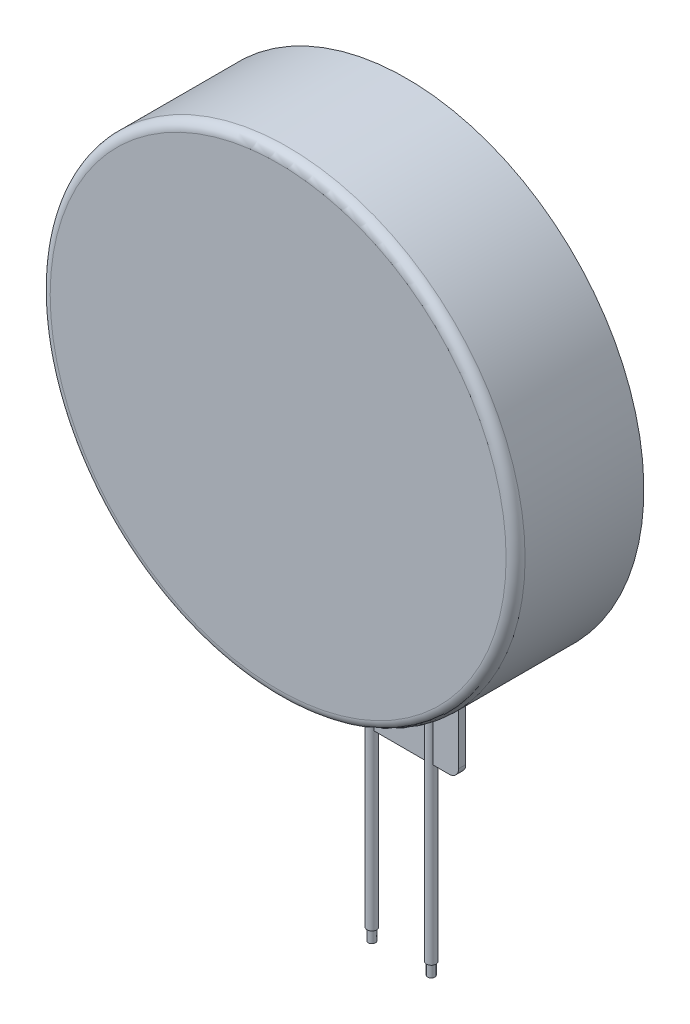
ISO-10303-21;
HEADER;
FILE_DESCRIPTION(('STEP AP214'),'2;1');
FILE_NAME('part.step','',(''),(''),'','','');
FILE_SCHEMA(('AUTOMOTIVE_DESIGN { 1 0 10303 214 1 1 1 1 }'));
ENDSEC;
DATA;
#1=APPLICATION_CONTEXT('core data for automotive mechanical design processes');
#2=APPLICATION_PROTOCOL_DEFINITION('international standard','automotive_design',2000,#1);
#3=PRODUCT_CONTEXT('',#1,'mechanical');
#4=PRODUCT('Part','Part','',(#3));
#5=PRODUCT_RELATED_PRODUCT_CATEGORY('part','',(#4));
#6=PRODUCT_DEFINITION_FORMATION('','',#4);
#7=PRODUCT_DEFINITION_CONTEXT('part definition',#1,'design');
#8=PRODUCT_DEFINITION('design','',#6,#7);
#9=PRODUCT_DEFINITION_SHAPE('','',#8);
#10=(LENGTH_UNIT() NAMED_UNIT(*) SI_UNIT(.MILLI.,.METRE.));
#11=(NAMED_UNIT(*) PLANE_ANGLE_UNIT() SI_UNIT($,.RADIAN.));
#12=(NAMED_UNIT(*) SI_UNIT($,.STERADIAN.) SOLID_ANGLE_UNIT());
#13=UNCERTAINTY_MEASURE_WITH_UNIT(LENGTH_MEASURE(1.E-05),#10,'distance_accuracy_value','');
#14=(GEOMETRIC_REPRESENTATION_CONTEXT(3) GLOBAL_UNCERTAINTY_ASSIGNED_CONTEXT((#13)) GLOBAL_UNIT_ASSIGNED_CONTEXT((#10,
#11,#12)) REPRESENTATION_CONTEXT('',''));
#15=CARTESIAN_POINT('',(0.,0.,0.));
#16=DIRECTION('',(0.,0.,1.));
#17=DIRECTION('',(1.,0.,0.));
#18=AXIS2_PLACEMENT_3D('',#15,#16,#17);
#19=CARTESIAN_POINT('',(0.625,-4.89122918275927,0.101));
#20=DIRECTION('',(0.,-1.,0.));
#21=DIRECTION('',(0.,0.,-1.));
#22=AXIS2_PLACEMENT_3D('',#19,#20,#21);
#23=CYLINDRICAL_SURFACE('',#22,0.101);
#24=CARTESIAN_POINT('',(0.625,-4.89122918275927,0.101));
#25=DIRECTION('',(0.,-1.,0.));
#26=DIRECTION('',(0.,0.,-1.));
#27=AXIS2_PLACEMENT_3D('',#24,#25,#26);
#28=CIRCLE('',#27,0.101);
#29=CARTESIAN_POINT('',(0.625,-4.89122918275927,0.));
#30=VERTEX_POINT('',#29);
#31=EDGE_CURVE('E12',#30,#30,#28,.T.);
#32=ORIENTED_EDGE('',*,*,#31,.T.);
#33=EDGE_LOOP('',(#32));
#34=FACE_BOUND('',#33,.T.);
#35=CARTESIAN_POINT('',(0.625,-10.7412291827593,0.101));
#36=DIRECTION('',(0.,-1.,0.));
#37=DIRECTION('',(0.,0.,-1.));
#38=AXIS2_PLACEMENT_3D('',#35,#36,#37);
#39=CIRCLE('',#38,0.101);
#40=CARTESIAN_POINT('',(0.625,-10.7412291827593,0.));
#41=VERTEX_POINT('',#40);
#42=EDGE_CURVE('E45',#41,#41,#39,.F.);
#43=ORIENTED_EDGE('',*,*,#42,.T.);
#44=EDGE_LOOP('',(#43));
#45=FACE_BOUND('',#44,.T.);
#46=ADVANCED_FACE('F42',(#34,#45),#23,.T.);
#47=CARTESIAN_POINT('',(0.625,-4.89122918275927,0.101));
#48=DIRECTION('',(0.,-1.,0.));
#49=DIRECTION('',(0.,0.,-1.));
#50=AXIS2_PLACEMENT_3D('',#47,#48,#49);
#51=PLANE('',#50);
#52=ORIENTED_EDGE('',*,*,#31,.F.);
#53=EDGE_LOOP('',(#52));
#54=FACE_BOUND('',#53,.T.);
#55=ADVANCED_FACE('F65',(#54),#51,.F.);
#56=CARTESIAN_POINT('',(0.,-10.7412291827593,1.35));
#57=DIRECTION('',(0.,-1.,0.));
#58=DIRECTION('',(0.,0.,-1.));
#59=AXIS2_PLACEMENT_3D('',#56,#57,#58);
#60=PLANE('',#59);
#61=ORIENTED_EDGE('',*,*,#42,.F.);
#62=EDGE_LOOP('',(#61));
#63=FACE_BOUND('',#62,.T.);
#64=CARTESIAN_POINT('',(0.625,-10.7412291827593,0.101));
#65=DIRECTION('',(0.,-1.,0.));
#66=DIRECTION('',(0.,0.,-1.));
#67=AXIS2_PLACEMENT_3D('',#64,#65,#66);
#68=CIRCLE('',#67,0.075);
#69=CARTESIAN_POINT('',(0.625,-10.7412291827593,0.026));
#70=VERTEX_POINT('',#69);
#71=EDGE_CURVE('E52',#70,#70,#68,.T.);
#72=ORIENTED_EDGE('',*,*,#71,.F.);
#73=EDGE_LOOP('',(#72));
#74=FACE_BOUND('',#73,.T.);
#75=ADVANCED_FACE('F63',(#63,#74),#60,.T.);
#76=CARTESIAN_POINT('',(0.625,-10.7412291827593,0.101));
#77=DIRECTION('',(0.,-1.,0.));
#78=DIRECTION('',(0.,0.,-1.));
#79=AXIS2_PLACEMENT_3D('',#76,#77,#78);
#80=CYLINDRICAL_SURFACE('',#79,0.075);
#81=ORIENTED_EDGE('',*,*,#71,.T.);
#82=EDGE_LOOP('',(#81));
#83=FACE_BOUND('',#82,.T.);
#84=CARTESIAN_POINT('',(0.625,-10.9912291827593,0.101));
#85=DIRECTION('',(0.,-1.,0.));
#86=DIRECTION('',(0.,0.,-1.));
#87=AXIS2_PLACEMENT_3D('',#84,#85,#86);
#88=CIRCLE('',#87,0.075);
#89=CARTESIAN_POINT('',(0.625,-10.9912291827593,0.026));
#90=VERTEX_POINT('',#89);
#91=EDGE_CURVE('E54',#90,#90,#88,.T.);
#92=ORIENTED_EDGE('',*,*,#91,.F.);
#93=EDGE_LOOP('',(#92));
#94=FACE_BOUND('',#93,.T.);
#95=ADVANCED_FACE('F60',(#83,#94),#80,.T.);
#96=CARTESIAN_POINT('',(0.625,-10.9912291827593,0.101));
#97=DIRECTION('',(0.,-1.,0.));
#98=DIRECTION('',(0.,0.,-1.));
#99=AXIS2_PLACEMENT_3D('',#96,#97,#98);
#100=PLANE('',#99);
#101=ORIENTED_EDGE('',*,*,#91,.T.);
#102=EDGE_LOOP('',(#101));
#103=FACE_BOUND('',#102,.T.);
#104=ADVANCED_FACE('F72',(#103),#100,.T.);
#105=CLOSED_SHELL('',(#46,#55,#75,#95,#104));
#106=MANIFOLD_SOLID_BREP('B2',#105);
#107=CARTESIAN_POINT('',(-0.625,-4.89122918275927,0.101));
#108=DIRECTION('',(0.,-1.,0.));
#109=DIRECTION('',(0.,0.,-1.));
#110=AXIS2_PLACEMENT_3D('',#107,#108,#109);
#111=CYLINDRICAL_SURFACE('',#110,0.101);
#112=CARTESIAN_POINT('',(-0.625,-4.89122918275927,0.101));
#113=DIRECTION('',(0.,-1.,0.));
#114=DIRECTION('',(0.,0.,-1.));
#115=AXIS2_PLACEMENT_3D('',#112,#113,#114);
#116=CIRCLE('',#115,0.101);
#117=CARTESIAN_POINT('',(-0.625,-4.89122918275927,0.));
#118=VERTEX_POINT('',#117);
#119=EDGE_CURVE('E41',#118,#118,#116,.T.);
#120=ORIENTED_EDGE('',*,*,#119,.T.);
#121=EDGE_LOOP('',(#120));
#122=FACE_BOUND('',#121,.T.);
#123=CARTESIAN_POINT('',(-0.625,-10.7412291827593,0.101));
#124=DIRECTION('',(0.,-1.,0.));
#125=DIRECTION('',(0.,0.,-1.));
#126=AXIS2_PLACEMENT_3D('',#123,#124,#125);
#127=CIRCLE('',#126,0.101);
#128=CARTESIAN_POINT('',(-0.625,-10.7412291827593,0.));
#129=VERTEX_POINT('',#128);
#130=EDGE_CURVE('E139',#129,#129,#127,.F.);
#131=ORIENTED_EDGE('',*,*,#130,.T.);
#132=EDGE_LOOP('',(#131));
#133=FACE_BOUND('',#132,.T.);
#134=ADVANCED_FACE('F136',(#122,#133),#111,.T.);
#135=CARTESIAN_POINT('',(-0.625,-4.89122918275927,0.101));
#136=DIRECTION('',(0.,-1.,0.));
#137=DIRECTION('',(0.,0.,-1.));
#138=AXIS2_PLACEMENT_3D('',#135,#136,#137);
#139=PLANE('',#138);
#140=ORIENTED_EDGE('',*,*,#119,.F.);
#141=EDGE_LOOP('',(#140));
#142=FACE_BOUND('',#141,.T.);
#143=ADVANCED_FACE('F159',(#142),#139,.F.);
#144=CARTESIAN_POINT('',(0.,-10.7412291827593,1.35));
#145=DIRECTION('',(0.,-1.,0.));
#146=DIRECTION('',(0.,0.,-1.));
#147=AXIS2_PLACEMENT_3D('',#144,#145,#146);
#148=PLANE('',#147);
#149=ORIENTED_EDGE('',*,*,#130,.F.);
#150=EDGE_LOOP('',(#149));
#151=FACE_BOUND('',#150,.T.);
#152=CARTESIAN_POINT('',(-0.625,-10.7412291827593,0.101));
#153=DIRECTION('',(0.,-1.,0.));
#154=DIRECTION('',(0.,0.,-1.));
#155=AXIS2_PLACEMENT_3D('',#152,#153,#154);
#156=CIRCLE('',#155,0.075);
#157=CARTESIAN_POINT('',(-0.625,-10.7412291827593,0.026));
#158=VERTEX_POINT('',#157);
#159=EDGE_CURVE('E146',#158,#158,#156,.T.);
#160=ORIENTED_EDGE('',*,*,#159,.F.);
#161=EDGE_LOOP('',(#160));
#162=FACE_BOUND('',#161,.T.);
#163=ADVANCED_FACE('F157',(#151,#162),#148,.T.);
#164=CARTESIAN_POINT('',(-0.625,-10.7412291827593,0.101));
#165=DIRECTION('',(0.,-1.,0.));
#166=DIRECTION('',(0.,0.,-1.));
#167=AXIS2_PLACEMENT_3D('',#164,#165,#166);
#168=CYLINDRICAL_SURFACE('',#167,0.075);
#169=ORIENTED_EDGE('',*,*,#159,.T.);
#170=EDGE_LOOP('',(#169));
#171=FACE_BOUND('',#170,.T.);
#172=CARTESIAN_POINT('',(-0.625,-10.9912291827593,0.101));
#173=DIRECTION('',(0.,-1.,0.));
#174=DIRECTION('',(0.,0.,-1.));
#175=AXIS2_PLACEMENT_3D('',#172,#173,#174);
#176=CIRCLE('',#175,0.075);
#177=CARTESIAN_POINT('',(-0.625,-10.9912291827593,0.026));
#178=VERTEX_POINT('',#177);
#179=EDGE_CURVE('E148',#178,#178,#176,.T.);
#180=ORIENTED_EDGE('',*,*,#179,.F.);
#181=EDGE_LOOP('',(#180));
#182=FACE_BOUND('',#181,.T.);
#183=ADVANCED_FACE('F154',(#171,#182),#168,.T.);
#184=CARTESIAN_POINT('',(-0.625,-10.9912291827593,0.101));
#185=DIRECTION('',(0.,-1.,0.));
#186=DIRECTION('',(0.,0.,-1.));
#187=AXIS2_PLACEMENT_3D('',#184,#185,#186);
#188=PLANE('',#187);
#189=ORIENTED_EDGE('',*,*,#179,.T.);
#190=EDGE_LOOP('',(#189));
#191=FACE_BOUND('',#190,.T.);
#192=ADVANCED_FACE('F166',(#191),#188,.T.);
#193=CLOSED_SHELL('',(#134,#143,#163,#183,#192));
#194=MANIFOLD_SOLID_BREP('B7',#193);
#195=CARTESIAN_POINT('',(0.,0.,2.7));
#196=DIRECTION('',(0.,0.,-1.));
#197=DIRECTION('',(-1.,0.,0.));
#198=AXIS2_PLACEMENT_3D('',#195,#196,#197);
#199=CYLINDRICAL_SURFACE('',#198,5.);
#200=CARTESIAN_POINT('',(0.,0.,2.5));
#201=DIRECTION('',(0.,0.,1.));
#202=DIRECTION('',(1.,0.,0.));
#203=AXIS2_PLACEMENT_3D('',#200,#201,#202);
#204=CIRCLE('',#203,5.);
#205=CARTESIAN_POINT('',(5.,0.,2.5));
#206=VERTEX_POINT('',#205);
#207=EDGE_CURVE('E134',#206,#206,#204,.F.);
#208=ORIENTED_EDGE('',*,*,#207,.T.);
#209=EDGE_LOOP('',(#208));
#210=FACE_BOUND('',#209,.T.);
#211=CARTESIAN_POINT('',(0.,0.,0.));
#212=DIRECTION('',(0.,0.,1.));
#213=DIRECTION('',(1.,0.,0.));
#214=AXIS2_PLACEMENT_3D('',#211,#212,#213);
#215=CIRCLE('',#214,5.);
#216=CARTESIAN_POINT('',(1.25,-4.84122918275927,0.));
#217=VERTEX_POINT('',#216);
#218=CARTESIAN_POINT('',(-1.25,-4.84122918275927,0.));
#219=VERTEX_POINT('',#218);
#220=EDGE_CURVE('E277',#217,#219,#215,.T.);
#221=ORIENTED_EDGE('',*,*,#220,.T.);
#222=DIRECTION('',(0.,0.,-1.));
#223=VECTOR('',#222,1.);
#224=CARTESIAN_POINT('',(-1.25,-4.84122918275927,2.7));
#225=LINE('',#224,#223);
#226=CARTESIAN_POINT('',(-1.25,-4.84122918275927,0.15));
#227=VERTEX_POINT('',#226);
#228=EDGE_CURVE('E288',#219,#227,#225,.F.);
#229=ORIENTED_EDGE('',*,*,#228,.T.);
#230=CARTESIAN_POINT('',(0.,0.,0.15));
#231=DIRECTION('',(0.,0.,1.));
#232=DIRECTION('',(1.,0.,0.));
#233=AXIS2_PLACEMENT_3D('',#230,#231,#232);
#234=CIRCLE('',#233,5.);
#235=CARTESIAN_POINT('',(1.25,-4.84122918275927,0.15));
#236=VERTEX_POINT('',#235);
#237=EDGE_CURVE('E287',#227,#236,#234,.T.);
#238=ORIENTED_EDGE('',*,*,#237,.T.);
#239=DIRECTION('',(0.,0.,-1.));
#240=VECTOR('',#239,1.);
#241=CARTESIAN_POINT('',(1.25,-4.84122918275927,2.7));
#242=LINE('',#241,#240);
#243=EDGE_CURVE('E291',#236,#217,#242,.T.);
#244=ORIENTED_EDGE('',*,*,#243,.T.);
#245=EDGE_LOOP('',(#221,#229,#238,#244));
#246=FACE_BOUND('',#245,.T.);
#247=ADVANCED_FACE('F221',(#210,#246),#199,.T.);
#248=CARTESIAN_POINT('',(0.,0.,2.7));
#249=DIRECTION('',(0.,0.,1.));
#250=DIRECTION('',(1.,0.,0.));
#251=AXIS2_PLACEMENT_3D('',#248,#249,#250);
#252=PLANE('',#251);
#253=CARTESIAN_POINT('',(0.,0.,2.7));
#254=DIRECTION('',(0.,0.,1.));
#255=DIRECTION('',(1.,0.,0.));
#256=AXIS2_PLACEMENT_3D('',#253,#254,#255);
#257=CIRCLE('',#256,4.8);
#258=CARTESIAN_POINT('',(4.8,0.,2.7));
#259=VERTEX_POINT('',#258);
#260=EDGE_CURVE('E229',#259,#259,#257,.T.);
#261=ORIENTED_EDGE('',*,*,#260,.T.);
#262=EDGE_LOOP('',(#261));
#263=FACE_BOUND('',#262,.T.);
#264=ADVANCED_FACE('F326',(#263),#252,.T.);
#265=CARTESIAN_POINT('',(0.,0.,0.));
#266=DIRECTION('',(0.,0.,1.));
#267=DIRECTION('',(1.,0.,0.));
#268=AXIS2_PLACEMENT_3D('',#265,#266,#267);
#269=PLANE('',#268);
#270=DIRECTION('',(-1.,0.,0.));
#271=VECTOR('',#270,1.);
#272=CARTESIAN_POINT('',(-1.25,-7.09122918275927,0.));
#273=LINE('',#272,#271);
#274=CARTESIAN_POINT('',(1.05,-7.09122918275927,0.));
#275=VERTEX_POINT('',#274);
#276=CARTESIAN_POINT('',(-1.05,-7.09122918275927,0.));
#277=VERTEX_POINT('',#276);
#278=EDGE_CURVE('E300',#275,#277,#273,.T.);
#279=ORIENTED_EDGE('',*,*,#278,.T.);
#280=CARTESIAN_POINT('',(-1.05,-6.89122918275927,0.));
#281=DIRECTION('',(0.,0.,1.));
#282=DIRECTION('',(1.,0.,0.));
#283=AXIS2_PLACEMENT_3D('',#280,#281,#282);
#284=CIRCLE('',#283,0.2);
#285=CARTESIAN_POINT('',(-1.25,-6.89122918275927,0.));
#286=VERTEX_POINT('',#285);
#287=EDGE_CURVE('E317',#277,#286,#284,.F.);
#288=ORIENTED_EDGE('',*,*,#287,.T.);
#289=DIRECTION('',(0.,1.,0.));
#290=VECTOR('',#289,1.);
#291=CARTESIAN_POINT('',(-1.25,-4.84122918275927,0.));
#292=LINE('',#291,#290);
#293=EDGE_CURVE('E283',#286,#219,#292,.T.);
#294=ORIENTED_EDGE('',*,*,#293,.T.);
#295=ORIENTED_EDGE('',*,*,#220,.F.);
#296=DIRECTION('',(0.,-1.,0.));
#297=VECTOR('',#296,1.);
#298=CARTESIAN_POINT('',(1.25,-4.84122918275927,0.));
#299=LINE('',#298,#297);
#300=CARTESIAN_POINT('',(1.25,-6.89122918275927,0.));
#301=VERTEX_POINT('',#300);
#302=EDGE_CURVE('E282',#217,#301,#299,.T.);
#303=ORIENTED_EDGE('',*,*,#302,.T.);
#304=CARTESIAN_POINT('',(1.05,-6.89122918275927,0.));
#305=DIRECTION('',(0.,0.,1.));
#306=DIRECTION('',(1.,0.,0.));
#307=AXIS2_PLACEMENT_3D('',#304,#305,#306);
#308=CIRCLE('',#307,0.2);
#309=EDGE_CURVE('E315',#301,#275,#308,.F.);
#310=ORIENTED_EDGE('',*,*,#309,.T.);
#311=EDGE_LOOP('',(#279,#288,#294,#295,#303,#310));
#312=FACE_BOUND('',#311,.T.);
#313=ADVANCED_FACE('F280',(#312),#269,.F.);
#314=CARTESIAN_POINT('',(0.,0.,0.15));
#315=DIRECTION('',(0.,0.,1.));
#316=DIRECTION('',(1.,0.,0.));
#317=AXIS2_PLACEMENT_3D('',#314,#315,#316);
#318=PLANE('',#317);
#319=DIRECTION('',(0.,1.,0.));
#320=VECTOR('',#319,1.);
#321=CARTESIAN_POINT('',(-1.25,-4.84122918275927,0.15));
#322=LINE('',#321,#320);
#323=CARTESIAN_POINT('',(-1.25,-6.89122918275927,0.15));
#324=VERTEX_POINT('',#323);
#325=EDGE_CURVE('E294',#324,#227,#322,.T.);
#326=ORIENTED_EDGE('',*,*,#325,.F.);
#327=CARTESIAN_POINT('',(-1.05,-6.89122918275927,0.15));
#328=DIRECTION('',(0.,0.,1.));
#329=DIRECTION('',(1.,0.,0.));
#330=AXIS2_PLACEMENT_3D('',#327,#328,#329);
#331=CIRCLE('',#330,0.2);
#332=CARTESIAN_POINT('',(-1.05,-7.09122918275927,0.15));
#333=VERTEX_POINT('',#332);
#334=EDGE_CURVE('E321',#324,#333,#331,.T.);
#335=ORIENTED_EDGE('',*,*,#334,.T.);
#336=DIRECTION('',(-1.,0.,0.));
#337=VECTOR('',#336,1.);
#338=CARTESIAN_POINT('',(-1.25,-7.09122918275927,0.15));
#339=LINE('',#338,#337);
#340=CARTESIAN_POINT('',(1.05,-7.09122918275927,0.15));
#341=VERTEX_POINT('',#340);
#342=EDGE_CURVE('E358',#341,#333,#339,.T.);
#343=ORIENTED_EDGE('',*,*,#342,.F.);
#344=CARTESIAN_POINT('',(1.05,-6.89122918275927,0.15));
#345=DIRECTION('',(0.,0.,1.));
#346=DIRECTION('',(1.,0.,0.));
#347=AXIS2_PLACEMENT_3D('',#344,#345,#346);
#348=CIRCLE('',#347,0.2);
#349=CARTESIAN_POINT('',(1.25,-6.89122918275927,0.15));
#350=VERTEX_POINT('',#349);
#351=EDGE_CURVE('E236',#341,#350,#348,.T.);
#352=ORIENTED_EDGE('',*,*,#351,.T.);
#353=DIRECTION('',(0.,-1.,0.));
#354=VECTOR('',#353,1.);
#355=CARTESIAN_POINT('',(1.25,-4.17973326244027,0.15));
#356=LINE('',#355,#354);
#357=EDGE_CURVE('E306',#236,#350,#356,.T.);
#358=ORIENTED_EDGE('',*,*,#357,.F.);
#359=ORIENTED_EDGE('',*,*,#237,.F.);
#360=EDGE_LOOP('',(#326,#335,#343,#352,#358,#359));
#361=FACE_BOUND('',#360,.T.);
#362=ADVANCED_FACE('F357',(#361),#318,.T.);
#363=CARTESIAN_POINT('',(-1.25,-4.84122918275927,0.15));
#364=DIRECTION('',(-1.,0.,0.));
#365=DIRECTION('',(0.,0.,1.));
#366=AXIS2_PLACEMENT_3D('',#363,#364,#365);
#367=PLANE('',#366);
#368=ORIENTED_EDGE('',*,*,#293,.F.);
#369=DIRECTION('',(0.,0.,-1.));
#370=VECTOR('',#369,1.);
#371=CARTESIAN_POINT('',(-1.25,-6.89122918275927,0.15));
#372=LINE('',#371,#370);
#373=EDGE_CURVE('E244',#286,#324,#372,.F.);
#374=ORIENTED_EDGE('',*,*,#373,.T.);
#375=ORIENTED_EDGE('',*,*,#325,.T.);
#376=ORIENTED_EDGE('',*,*,#228,.F.);
#377=EDGE_LOOP('',(#368,#374,#375,#376));
#378=FACE_BOUND('',#377,.T.);
#379=ADVANCED_FACE('F362',(#378),#367,.T.);
#380=CARTESIAN_POINT('',(1.25,-4.84122918275927,0.15));
#381=DIRECTION('',(1.,0.,0.));
#382=DIRECTION('',(0.,1.,0.));
#383=AXIS2_PLACEMENT_3D('',#380,#381,#382);
#384=PLANE('',#383);
#385=ORIENTED_EDGE('',*,*,#357,.T.);
#386=DIRECTION('',(0.,0.,-1.));
#387=VECTOR('',#386,1.);
#388=CARTESIAN_POINT('',(1.25,-6.89122918275927,0.15));
#389=LINE('',#388,#387);
#390=EDGE_CURVE('E299',#350,#301,#389,.T.);
#391=ORIENTED_EDGE('',*,*,#390,.T.);
#392=ORIENTED_EDGE('',*,*,#302,.F.);
#393=ORIENTED_EDGE('',*,*,#243,.F.);
#394=EDGE_LOOP('',(#385,#391,#392,#393));
#395=FACE_BOUND('',#394,.T.);
#396=ADVANCED_FACE('F297',(#395),#384,.T.);
#397=CARTESIAN_POINT('',(-1.25,-7.09122918275927,0.15));
#398=DIRECTION('',(0.,-1.,0.));
#399=DIRECTION('',(0.,0.,-1.));
#400=AXIS2_PLACEMENT_3D('',#397,#398,#399);
#401=PLANE('',#400);
#402=ORIENTED_EDGE('',*,*,#342,.T.);
#403=DIRECTION('',(0.,0.,-1.));
#404=VECTOR('',#403,1.);
#405=CARTESIAN_POINT('',(-1.05,-7.09122918275927,0.15));
#406=LINE('',#405,#404);
#407=EDGE_CURVE('E312',#333,#277,#406,.T.);
#408=ORIENTED_EDGE('',*,*,#407,.T.);
#409=ORIENTED_EDGE('',*,*,#278,.F.);
#410=DIRECTION('',(0.,0.,-1.));
#411=VECTOR('',#410,1.);
#412=CARTESIAN_POINT('',(1.05,-7.09122918275927,0.15));
#413=LINE('',#412,#411);
#414=EDGE_CURVE('E310',#275,#341,#413,.F.);
#415=ORIENTED_EDGE('',*,*,#414,.T.);
#416=EDGE_LOOP('',(#402,#408,#409,#415));
#417=FACE_BOUND('',#416,.T.);
#418=ADVANCED_FACE('F347',(#417),#401,.T.);
#419=CARTESIAN_POINT('',(-1.05,-6.89122918275927,0.15));
#420=DIRECTION('',(0.,0.,-1.));
#421=DIRECTION('',(-1.,0.,0.));
#422=AXIS2_PLACEMENT_3D('',#419,#420,#421);
#423=CYLINDRICAL_SURFACE('',#422,0.2);
#424=ORIENTED_EDGE('',*,*,#334,.F.);
#425=ORIENTED_EDGE('',*,*,#373,.F.);
#426=ORIENTED_EDGE('',*,*,#287,.F.);
#427=ORIENTED_EDGE('',*,*,#407,.F.);
#428=EDGE_LOOP('',(#424,#425,#426,#427));
#429=FACE_BOUND('',#428,.T.);
#430=ADVANCED_FACE('F334',(#429),#423,.T.);
#431=CARTESIAN_POINT('',(1.05,-6.89122918275927,0.15));
#432=DIRECTION('',(0.,0.,-1.));
#433=DIRECTION('',(-1.,0.,0.));
#434=AXIS2_PLACEMENT_3D('',#431,#432,#433);
#435=CYLINDRICAL_SURFACE('',#434,0.2);
#436=ORIENTED_EDGE('',*,*,#351,.F.);
#437=ORIENTED_EDGE('',*,*,#414,.F.);
#438=ORIENTED_EDGE('',*,*,#309,.F.);
#439=ORIENTED_EDGE('',*,*,#390,.F.);
#440=EDGE_LOOP('',(#436,#437,#438,#439));
#441=FACE_BOUND('',#440,.T.);
#442=ADVANCED_FACE('F329',(#441),#435,.T.);
#443=CARTESIAN_POINT('',(0.,0.,2.5));
#444=DIRECTION('',(0.,0.,1.));
#445=DIRECTION('',(1.,0.,0.));
#446=AXIS2_PLACEMENT_3D('',#443,#444,#445);
#447=TOROIDAL_SURFACE('',#446,4.8,0.2);
#448=ORIENTED_EDGE('',*,*,#207,.F.);
#449=EDGE_LOOP('',(#448));
#450=FACE_BOUND('',#449,.T.);
#451=ORIENTED_EDGE('',*,*,#260,.F.);
#452=EDGE_LOOP('',(#451));
#453=FACE_BOUND('',#452,.T.);
#454=ADVANCED_FACE('F223',(#450,#453),#447,.T.);
#455=CLOSED_SHELL('',(#247,#264,#313,#362,#379,#396,#418,#430,#442,#454));
#456=MANIFOLD_SOLID_BREP('B36',#455);
#457=ADVANCED_BREP_SHAPE_REPRESENTATION('',(#18,#106,#194,#456),#14);
#458=SHAPE_DEFINITION_REPRESENTATION(#9,#457);
ENDSEC;
END-ISO-10303-21;
